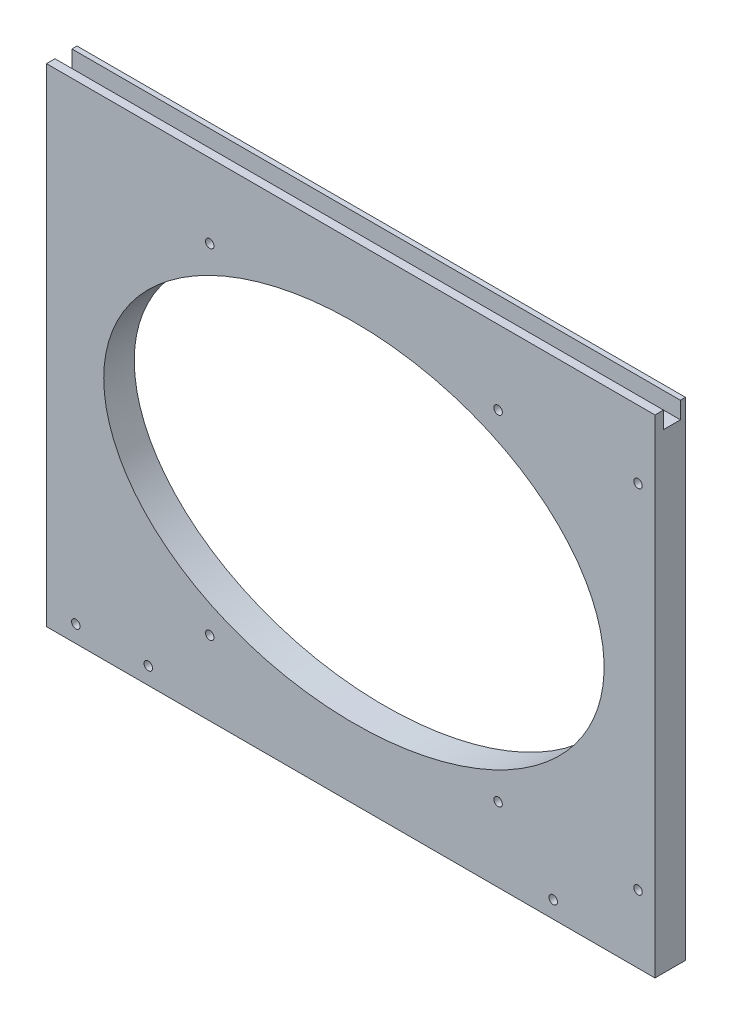
ISO-10303-21;
HEADER;
FILE_DESCRIPTION(('STEP AP214'),'2;1');
FILE_NAME('part.step','',(''),(''),'','','');
FILE_SCHEMA(('AUTOMOTIVE_DESIGN { 1 0 10303 214 1 1 1 1 }'));
ENDSEC;
DATA;
#1=APPLICATION_CONTEXT('core data for automotive mechanical design processes');
#2=APPLICATION_PROTOCOL_DEFINITION('international standard','automotive_design',2000,#1);
#3=PRODUCT_CONTEXT('',#1,'mechanical');
#4=PRODUCT('Part','Part','',(#3));
#5=PRODUCT_RELATED_PRODUCT_CATEGORY('part','',(#4));
#6=PRODUCT_DEFINITION_FORMATION('','',#4);
#7=PRODUCT_DEFINITION_CONTEXT('part definition',#1,'design');
#8=PRODUCT_DEFINITION('design','',#6,#7);
#9=PRODUCT_DEFINITION_SHAPE('','',#8);
#10=(LENGTH_UNIT() NAMED_UNIT(*) SI_UNIT(.MILLI.,.METRE.));
#11=(NAMED_UNIT(*) PLANE_ANGLE_UNIT() SI_UNIT($,.RADIAN.));
#12=(NAMED_UNIT(*) SI_UNIT($,.STERADIAN.) SOLID_ANGLE_UNIT());
#13=UNCERTAINTY_MEASURE_WITH_UNIT(LENGTH_MEASURE(1.E-05),#10,'distance_accuracy_value','');
#14=(GEOMETRIC_REPRESENTATION_CONTEXT(3) GLOBAL_UNCERTAINTY_ASSIGNED_CONTEXT((#13)) GLOBAL_UNIT_ASSIGNED_CONTEXT((#10,
#11,#12)) REPRESENTATION_CONTEXT('',''));
#15=CARTESIAN_POINT('',(0.,0.,0.));
#16=DIRECTION('',(0.,0.,1.));
#17=DIRECTION('',(1.,0.,0.));
#18=AXIS2_PLACEMENT_3D('',#15,#16,#17);
#19=CARTESIAN_POINT('',(-5512.59375,1181.1,-11.43));
#20=DIRECTION('',(0.,1.,0.));
#21=DIRECTION('',(0.,0.,1.));
#22=AXIS2_PLACEMENT_3D('',#19,#20,#21);
#23=PLANE('',#22);
#24=DIRECTION('',(1.,0.,0.));
#25=VECTOR('',#24,1.);
#26=CARTESIAN_POINT('',(-5749.38025612107,1181.1,-3.175));
#27=LINE('',#26,#25);
#28=CARTESIAN_POINT('',(-5740.4,1181.1,-3.175));
#29=VERTEX_POINT('',#28);
#30=CARTESIAN_POINT('',(-5512.59375,1181.1,-3.175));
#31=VERTEX_POINT('',#30);
#32=EDGE_CURVE('E109',#29,#31,#27,.T.);
#33=ORIENTED_EDGE('',*,*,#32,.F.);
#34=DIRECTION('',(0.,0.,1.));
#35=VECTOR('',#34,1.);
#36=CARTESIAN_POINT('',(-5740.4,1181.1,-11.43));
#37=LINE('',#36,#35);
#38=CARTESIAN_POINT('',(-5740.4,1181.1,0.));
#39=VERTEX_POINT('',#38);
#40=EDGE_CURVE('E118',#29,#39,#37,.T.);
#41=ORIENTED_EDGE('',*,*,#40,.T.);
#42=DIRECTION('',(-1.,0.,0.));
#43=VECTOR('',#42,1.);
#44=CARTESIAN_POINT('',(-5512.59375,1181.1,0.));
#45=LINE('',#44,#43);
#46=CARTESIAN_POINT('',(-5512.59375,1181.1,0.));
#47=VERTEX_POINT('',#46);
#48=EDGE_CURVE('E132',#47,#39,#45,.T.);
#49=ORIENTED_EDGE('',*,*,#48,.F.);
#50=DIRECTION('',(0.,0.,1.));
#51=VECTOR('',#50,1.);
#52=CARTESIAN_POINT('',(-5512.59375,1181.1,-11.43));
#53=LINE('',#52,#51);
#54=EDGE_CURVE('E120',#31,#47,#53,.T.);
#55=ORIENTED_EDGE('',*,*,#54,.F.);
#56=EDGE_LOOP('',(#33,#41,#49,#55));
#57=FACE_BOUND('',#56,.T.);
#58=ADVANCED_FACE('F31',(#57),#23,.T.);
#59=CARTESIAN_POINT('',(-5740.4,998.5375,-11.43));
#60=DIRECTION('',(0.,-1.,0.));
#61=DIRECTION('',(0.,0.,-1.));
#62=AXIS2_PLACEMENT_3D('',#59,#60,#61);
#63=PLANE('',#62);
#64=DIRECTION('',(1.,0.,0.));
#65=VECTOR('',#64,1.);
#66=CARTESIAN_POINT('',(-5740.4,998.5375,0.));
#67=LINE('',#66,#65);
#68=CARTESIAN_POINT('',(-5740.4,998.5375,0.));
#69=VERTEX_POINT('',#68);
#70=CARTESIAN_POINT('',(-5512.59375,998.5375,0.));
#71=VERTEX_POINT('',#70);
#72=EDGE_CURVE('E137',#69,#71,#67,.T.);
#73=ORIENTED_EDGE('',*,*,#72,.F.);
#74=DIRECTION('',(0.,0.,1.));
#75=VECTOR('',#74,1.);
#76=CARTESIAN_POINT('',(-5740.4,998.5375,-11.43));
#77=LINE('',#76,#75);
#78=CARTESIAN_POINT('',(-5740.4,998.5375,-11.43));
#79=VERTEX_POINT('',#78);
#80=EDGE_CURVE('E11',#79,#69,#77,.T.);
#81=ORIENTED_EDGE('',*,*,#80,.F.);
#82=DIRECTION('',(1.,0.,0.));
#83=VECTOR('',#82,1.);
#84=CARTESIAN_POINT('',(-5740.4,998.5375,-11.43));
#85=LINE('',#84,#83);
#86=CARTESIAN_POINT('',(-5512.59375,998.5375,-11.43));
#87=VERTEX_POINT('',#86);
#88=EDGE_CURVE('E131',#79,#87,#85,.T.);
#89=ORIENTED_EDGE('',*,*,#88,.T.);
#90=DIRECTION('',(0.,0.,1.));
#91=VECTOR('',#90,1.);
#92=CARTESIAN_POINT('',(-5512.59375,998.5375,-11.43));
#93=LINE('',#92,#91);
#94=EDGE_CURVE('E35',#87,#71,#93,.T.);
#95=ORIENTED_EDGE('',*,*,#94,.T.);
#96=EDGE_LOOP('',(#73,#81,#89,#95));
#97=FACE_BOUND('',#96,.T.);
#98=ADVANCED_FACE('F33',(#97),#63,.T.);
#99=CARTESIAN_POINT('',(-5740.4,1181.1,-11.43));
#100=DIRECTION('',(-1.,0.,0.));
#101=DIRECTION('',(0.,0.,1.));
#102=AXIS2_PLACEMENT_3D('',#99,#100,#101);
#103=PLANE('',#102);
#104=DIRECTION('',(0.,-1.,0.));
#105=VECTOR('',#104,1.);
#106=CARTESIAN_POINT('',(-5740.4,1181.1,-3.175));
#107=LINE('',#106,#105);
#108=CARTESIAN_POINT('',(-5740.4,1174.75,-3.175));
#109=VERTEX_POINT('',#108);
#110=EDGE_CURVE('E105',#29,#109,#107,.T.);
#111=ORIENTED_EDGE('',*,*,#110,.T.);
#112=DIRECTION('',(0.,0.,-1.));
#113=VECTOR('',#112,1.);
#114=CARTESIAN_POINT('',(-5740.4,1174.75,-3.175));
#115=LINE('',#114,#113);
#116=CARTESIAN_POINT('',(-5740.4,1174.75,-9.525));
#117=VERTEX_POINT('',#116);
#118=EDGE_CURVE('E203',#109,#117,#115,.T.);
#119=ORIENTED_EDGE('',*,*,#118,.T.);
#120=DIRECTION('',(0.,1.,0.));
#121=VECTOR('',#120,1.);
#122=CARTESIAN_POINT('',(-5740.4,1174.75,-9.525));
#123=LINE('',#122,#121);
#124=CARTESIAN_POINT('',(-5740.4,1181.1,-9.525));
#125=VERTEX_POINT('',#124);
#126=EDGE_CURVE('E198',#117,#125,#123,.T.);
#127=ORIENTED_EDGE('',*,*,#126,.T.);
#128=CARTESIAN_POINT('',(-5740.4,1181.1,-11.43));
#129=VERTEX_POINT('',#128);
#130=EDGE_CURVE('E40',#129,#125,#37,.T.);
#131=ORIENTED_EDGE('',*,*,#130,.F.);
#132=DIRECTION('',(0.,-1.,0.));
#133=VECTOR('',#132,1.);
#134=CARTESIAN_POINT('',(-5740.4,1181.1,-11.43));
#135=LINE('',#134,#133);
#136=EDGE_CURVE('E141',#129,#79,#135,.T.);
#137=ORIENTED_EDGE('',*,*,#136,.T.);
#138=ORIENTED_EDGE('',*,*,#80,.T.);
#139=DIRECTION('',(0.,-1.,0.));
#140=VECTOR('',#139,1.);
#141=CARTESIAN_POINT('',(-5740.4,1181.1,0.));
#142=LINE('',#141,#140);
#143=EDGE_CURVE('E124',#39,#69,#142,.T.);
#144=ORIENTED_EDGE('',*,*,#143,.F.);
#145=ORIENTED_EDGE('',*,*,#40,.F.);
#146=EDGE_LOOP('',(#111,#119,#127,#131,#137,#138,#144,#145));
#147=FACE_BOUND('',#146,.T.);
#148=ADVANCED_FACE('F122',(#147),#103,.T.);
#149=DIRECTION('',(1.,0.,0.));
#150=VECTOR('',#149,1.);
#151=CARTESIAN_POINT('',(-5749.38025612107,1181.1,-9.525));
#152=LINE('',#151,#150);
#153=CARTESIAN_POINT('',(-5512.59375,1181.1,-9.525));
#154=VERTEX_POINT('',#153);
#155=EDGE_CURVE('E201',#125,#154,#152,.T.);
#156=ORIENTED_EDGE('',*,*,#155,.T.);
#157=CARTESIAN_POINT('',(-5512.59375,1181.1,-11.43));
#158=VERTEX_POINT('',#157);
#159=EDGE_CURVE('E125',#158,#154,#53,.T.);
#160=ORIENTED_EDGE('',*,*,#159,.F.);
#161=DIRECTION('',(-1.,0.,0.));
#162=VECTOR('',#161,1.);
#163=CARTESIAN_POINT('',(-5512.59375,1181.1,-11.43));
#164=LINE('',#163,#162);
#165=EDGE_CURVE('E143',#158,#129,#164,.T.);
#166=ORIENTED_EDGE('',*,*,#165,.T.);
#167=ORIENTED_EDGE('',*,*,#130,.T.);
#168=EDGE_LOOP('',(#156,#160,#166,#167));
#169=FACE_BOUND('',#168,.T.);
#170=ADVANCED_FACE('F177',(#169),#23,.T.);
#171=CARTESIAN_POINT('',(-5512.59375,998.5375,-11.43));
#172=DIRECTION('',(1.,0.,0.));
#173=DIRECTION('',(0.,0.,-1.));
#174=AXIS2_PLACEMENT_3D('',#171,#172,#173);
#175=PLANE('',#174);
#176=DIRECTION('',(0.,-1.,0.));
#177=VECTOR('',#176,1.);
#178=CARTESIAN_POINT('',(-5512.59375,1181.1,-3.175));
#179=LINE('',#178,#177);
#180=CARTESIAN_POINT('',(-5512.59375,1174.75,-3.175));
#181=VERTEX_POINT('',#180);
#182=EDGE_CURVE('E190',#31,#181,#179,.T.);
#183=ORIENTED_EDGE('',*,*,#182,.F.);
#184=ORIENTED_EDGE('',*,*,#54,.T.);
#185=DIRECTION('',(0.,1.,0.));
#186=VECTOR('',#185,1.);
#187=CARTESIAN_POINT('',(-5512.59375,998.5375,0.));
#188=LINE('',#187,#186);
#189=EDGE_CURVE('E134',#71,#47,#188,.T.);
#190=ORIENTED_EDGE('',*,*,#189,.F.);
#191=ORIENTED_EDGE('',*,*,#94,.F.);
#192=DIRECTION('',(0.,1.,0.));
#193=VECTOR('',#192,1.);
#194=CARTESIAN_POINT('',(-5512.59375,998.5375,-11.43));
#195=LINE('',#194,#193);
#196=EDGE_CURVE('E146',#87,#158,#195,.T.);
#197=ORIENTED_EDGE('',*,*,#196,.T.);
#198=ORIENTED_EDGE('',*,*,#159,.T.);
#199=DIRECTION('',(0.,1.,0.));
#200=VECTOR('',#199,1.);
#201=CARTESIAN_POINT('',(-5512.59375,1174.75,-9.525));
#202=LINE('',#201,#200);
#203=CARTESIAN_POINT('',(-5512.59375,1174.75,-9.525));
#204=VERTEX_POINT('',#203);
#205=EDGE_CURVE('E192',#204,#154,#202,.T.);
#206=ORIENTED_EDGE('',*,*,#205,.F.);
#207=DIRECTION('',(0.,0.,-1.));
#208=VECTOR('',#207,1.);
#209=CARTESIAN_POINT('',(-5512.59375,1174.75,-3.175));
#210=LINE('',#209,#208);
#211=EDGE_CURVE('E48',#181,#204,#210,.T.);
#212=ORIENTED_EDGE('',*,*,#211,.F.);
#213=EDGE_LOOP('',(#183,#184,#190,#191,#197,#198,#206,#212));
#214=FACE_BOUND('',#213,.T.);
#215=ADVANCED_FACE('F170',(#214),#175,.T.);
#216=CARTESIAN_POINT('',(-5512.59375,998.5375,-11.43));
#217=DIRECTION('',(0.,0.,1.));
#218=DIRECTION('',(1.,0.,0.));
#219=AXIS2_PLACEMENT_3D('',#216,#217,#218);
#220=PLANE('',#219);
#221=CARTESIAN_POINT('',(-5729.43355,1004.8875,-11.43));
#222=DIRECTION('',(0.,0.,-1.));
#223=DIRECTION('',(-1.,0.,0.));
#224=AXIS2_PLACEMENT_3D('',#221,#222,#223);
#225=CIRCLE('',#224,1.5874999999996);
#226=CARTESIAN_POINT('',(-5731.02105,1004.8875,-11.43));
#227=VERTEX_POINT('',#226);
#228=EDGE_CURVE('E430',#227,#227,#225,.T.);
#229=ORIENTED_EDGE('',*,*,#228,.F.);
#230=EDGE_LOOP('',(#229));
#231=FACE_BOUND('',#230,.T.);
#232=CARTESIAN_POINT('',(-5679.28125,1153.31875,-11.43));
#233=DIRECTION('',(0.,0.,1.));
#234=DIRECTION('',(1.,0.,0.));
#235=AXIS2_PLACEMENT_3D('',#232,#233,#234);
#236=CIRCLE('',#235,1.58750000000051);
#237=CARTESIAN_POINT('',(-5677.69375,1153.31875,-11.43));
#238=VERTEX_POINT('',#237);
#239=EDGE_CURVE('E212',#238,#238,#236,.F.);
#240=ORIENTED_EDGE('',*,*,#239,.F.);
#241=EDGE_LOOP('',(#240));
#242=FACE_BOUND('',#241,.T.);
#243=CARTESIAN_POINT('',(-5702.3,1004.8875,-11.43));
#244=DIRECTION('',(0.,0.,1.));
#245=DIRECTION('',(1.,0.,0.));
#246=AXIS2_PLACEMENT_3D('',#243,#244,#245);
#247=CIRCLE('',#246,1.58750000000051);
#248=CARTESIAN_POINT('',(-5700.7125,1004.8875,-11.43));
#249=VERTEX_POINT('',#248);
#250=EDGE_CURVE('E218',#249,#249,#247,.F.);
#251=ORIENTED_EDGE('',*,*,#250,.F.);
#252=EDGE_LOOP('',(#251));
#253=FACE_BOUND('',#252,.T.);
#254=CARTESIAN_POINT('',(-5679.28125,1026.31875,-11.43));
#255=DIRECTION('',(0.,0.,1.));
#256=DIRECTION('',(1.,0.,0.));
#257=AXIS2_PLACEMENT_3D('',#254,#255,#256);
#258=CIRCLE('',#257,1.58750000000045);
#259=CARTESIAN_POINT('',(-5677.69375,1026.31875,-11.43));
#260=VERTEX_POINT('',#259);
#261=EDGE_CURVE('E224',#260,#260,#258,.F.);
#262=ORIENTED_EDGE('',*,*,#261,.F.);
#263=EDGE_LOOP('',(#262));
#264=FACE_BOUND('',#263,.T.);
#265=CARTESIAN_POINT('',(-5571.33125,1026.31875,-11.43));
#266=DIRECTION('',(0.,0.,1.));
#267=DIRECTION('',(1.,0.,0.));
#268=AXIS2_PLACEMENT_3D('',#265,#266,#267);
#269=CIRCLE('',#268,1.58750000000045);
#270=CARTESIAN_POINT('',(-5569.74375,1026.31875,-11.43));
#271=VERTEX_POINT('',#270);
#272=EDGE_CURVE('E230',#271,#271,#269,.F.);
#273=ORIENTED_EDGE('',*,*,#272,.F.);
#274=EDGE_LOOP('',(#273));
#275=FACE_BOUND('',#274,.T.);
#276=CARTESIAN_POINT('',(-5550.69375,1004.8875,-11.43));
#277=DIRECTION('',(0.,0.,1.));
#278=DIRECTION('',(1.,0.,0.));
#279=AXIS2_PLACEMENT_3D('',#276,#277,#278);
#280=CIRCLE('',#279,1.58750000000051);
#281=CARTESIAN_POINT('',(-5549.10625,1004.8875,-11.43));
#282=VERTEX_POINT('',#281);
#283=EDGE_CURVE('E236',#282,#282,#280,.F.);
#284=ORIENTED_EDGE('',*,*,#283,.F.);
#285=EDGE_LOOP('',(#284));
#286=FACE_BOUND('',#285,.T.);
#287=CARTESIAN_POINT('',(-5518.94375,1023.9375,-11.43));
#288=DIRECTION('',(0.,0.,1.));
#289=DIRECTION('',(1.,0.,0.));
#290=AXIS2_PLACEMENT_3D('',#287,#288,#289);
#291=CIRCLE('',#290,1.58750000000051);
#292=CARTESIAN_POINT('',(-5517.35625,1023.9375,-11.43));
#293=VERTEX_POINT('',#292);
#294=EDGE_CURVE('E242',#293,#293,#291,.F.);
#295=ORIENTED_EDGE('',*,*,#294,.F.);
#296=EDGE_LOOP('',(#295));
#297=FACE_BOUND('',#296,.T.);
#298=CARTESIAN_POINT('',(-5518.94375,1155.7,-11.43));
#299=DIRECTION('',(0.,0.,1.));
#300=DIRECTION('',(1.,0.,0.));
#301=AXIS2_PLACEMENT_3D('',#298,#299,#300);
#302=CIRCLE('',#301,1.58750000000051);
#303=CARTESIAN_POINT('',(-5517.35625,1155.7,-11.43));
#304=VERTEX_POINT('',#303);
#305=EDGE_CURVE('E248',#304,#304,#302,.F.);
#306=ORIENTED_EDGE('',*,*,#305,.F.);
#307=EDGE_LOOP('',(#306));
#308=FACE_BOUND('',#307,.T.);
#309=CARTESIAN_POINT('',(-5571.33125,1153.31875,-11.43));
#310=DIRECTION('',(0.,0.,1.));
#311=DIRECTION('',(1.,0.,0.));
#312=AXIS2_PLACEMENT_3D('',#309,#310,#311);
#313=CIRCLE('',#312,1.58750000000045);
#314=CARTESIAN_POINT('',(-5569.74375,1153.31875,-11.43));
#315=VERTEX_POINT('',#314);
#316=EDGE_CURVE('E154',#315,#315,#313,.F.);
#317=ORIENTED_EDGE('',*,*,#316,.F.);
#318=EDGE_LOOP('',(#317));
#319=FACE_BOUND('',#318,.T.);
#320=CARTESIAN_POINT('',(-5625.30625,1089.81875,-11.43));
#321=DIRECTION('',(0.,0.,1.));
#322=DIRECTION('',(-1.,0.,0.));
#323=AXIS2_PLACEMENT_3D('',#320,#321,#322);
#324=ELLIPSE('',#323,93.6624999999998,65.0874999965074);
#325=CARTESIAN_POINT('',(-5718.96875,1089.81875,-11.43));
#326=VERTEX_POINT('',#325);
#327=EDGE_CURVE('E140',#326,#326,#324,.F.);
#328=ORIENTED_EDGE('',*,*,#327,.F.);
#329=EDGE_LOOP('',(#328));
#330=FACE_BOUND('',#329,.T.);
#331=ORIENTED_EDGE('',*,*,#88,.F.);
#332=ORIENTED_EDGE('',*,*,#136,.F.);
#333=ORIENTED_EDGE('',*,*,#165,.F.);
#334=ORIENTED_EDGE('',*,*,#196,.F.);
#335=EDGE_LOOP('',(#331,#332,#333,#334));
#336=FACE_BOUND('',#335,.T.);
#337=ADVANCED_FACE('F167',(#231,#242,#253,#264,#275,#286,#297,#308,#319,#330,#336),#220,.F.);
#338=CARTESIAN_POINT('',(-5512.59375,998.5375,0.));
#339=DIRECTION('',(0.,0.,1.));
#340=DIRECTION('',(1.,0.,0.));
#341=AXIS2_PLACEMENT_3D('',#338,#339,#340);
#342=PLANE('',#341);
#343=CARTESIAN_POINT('',(-5729.43355,1004.8875,0.));
#344=DIRECTION('',(0.,0.,1.));
#345=DIRECTION('',(1.,0.,0.));
#346=AXIS2_PLACEMENT_3D('',#343,#344,#345);
#347=CIRCLE('',#346,1.5874999999996);
#348=CARTESIAN_POINT('',(-5727.84605,1004.8875,0.));
#349=VERTEX_POINT('',#348);
#350=EDGE_CURVE('E195',#349,#349,#347,.F.);
#351=ORIENTED_EDGE('',*,*,#350,.T.);
#352=EDGE_LOOP('',(#351));
#353=FACE_BOUND('',#352,.T.);
#354=CARTESIAN_POINT('',(-5679.28125,1153.31875,0.));
#355=DIRECTION('',(0.,0.,1.));
#356=DIRECTION('',(1.,0.,0.));
#357=AXIS2_PLACEMENT_3D('',#354,#355,#356);
#358=CIRCLE('',#357,1.58750000000051);
#359=CARTESIAN_POINT('',(-5677.69375,1153.31875,0.));
#360=VERTEX_POINT('',#359);
#361=EDGE_CURVE('E207',#360,#360,#358,.T.);
#362=ORIENTED_EDGE('',*,*,#361,.F.);
#363=EDGE_LOOP('',(#362));
#364=FACE_BOUND('',#363,.T.);
#365=CARTESIAN_POINT('',(-5702.3,1004.8875,0.));
#366=DIRECTION('',(0.,0.,1.));
#367=DIRECTION('',(1.,0.,0.));
#368=AXIS2_PLACEMENT_3D('',#365,#366,#367);
#369=CIRCLE('',#368,1.58750000000051);
#370=CARTESIAN_POINT('',(-5700.7125,1004.8875,0.));
#371=VERTEX_POINT('',#370);
#372=EDGE_CURVE('E215',#371,#371,#369,.T.);
#373=ORIENTED_EDGE('',*,*,#372,.F.);
#374=EDGE_LOOP('',(#373));
#375=FACE_BOUND('',#374,.T.);
#376=CARTESIAN_POINT('',(-5679.28125,1026.31875,0.));
#377=DIRECTION('',(0.,0.,1.));
#378=DIRECTION('',(1.,0.,0.));
#379=AXIS2_PLACEMENT_3D('',#376,#377,#378);
#380=CIRCLE('',#379,1.58750000000045);
#381=CARTESIAN_POINT('',(-5677.69375,1026.31875,0.));
#382=VERTEX_POINT('',#381);
#383=EDGE_CURVE('E221',#382,#382,#380,.T.);
#384=ORIENTED_EDGE('',*,*,#383,.F.);
#385=EDGE_LOOP('',(#384));
#386=FACE_BOUND('',#385,.T.);
#387=CARTESIAN_POINT('',(-5571.33125,1026.31875,0.));
#388=DIRECTION('',(0.,0.,1.));
#389=DIRECTION('',(1.,0.,0.));
#390=AXIS2_PLACEMENT_3D('',#387,#388,#389);
#391=CIRCLE('',#390,1.58750000000045);
#392=CARTESIAN_POINT('',(-5569.74375,1026.31875,0.));
#393=VERTEX_POINT('',#392);
#394=EDGE_CURVE('E227',#393,#393,#391,.T.);
#395=ORIENTED_EDGE('',*,*,#394,.F.);
#396=EDGE_LOOP('',(#395));
#397=FACE_BOUND('',#396,.T.);
#398=CARTESIAN_POINT('',(-5550.69375,1004.8875,0.));
#399=DIRECTION('',(0.,0.,1.));
#400=DIRECTION('',(1.,0.,0.));
#401=AXIS2_PLACEMENT_3D('',#398,#399,#400);
#402=CIRCLE('',#401,1.58750000000051);
#403=CARTESIAN_POINT('',(-5549.10625,1004.8875,0.));
#404=VERTEX_POINT('',#403);
#405=EDGE_CURVE('E233',#404,#404,#402,.T.);
#406=ORIENTED_EDGE('',*,*,#405,.F.);
#407=EDGE_LOOP('',(#406));
#408=FACE_BOUND('',#407,.T.);
#409=CARTESIAN_POINT('',(-5518.94375,1023.9375,0.));
#410=DIRECTION('',(0.,0.,1.));
#411=DIRECTION('',(1.,0.,0.));
#412=AXIS2_PLACEMENT_3D('',#409,#410,#411);
#413=CIRCLE('',#412,1.58750000000051);
#414=CARTESIAN_POINT('',(-5517.35625,1023.9375,0.));
#415=VERTEX_POINT('',#414);
#416=EDGE_CURVE('E239',#415,#415,#413,.T.);
#417=ORIENTED_EDGE('',*,*,#416,.F.);
#418=EDGE_LOOP('',(#417));
#419=FACE_BOUND('',#418,.T.);
#420=CARTESIAN_POINT('',(-5518.94375,1155.7,0.));
#421=DIRECTION('',(0.,0.,1.));
#422=DIRECTION('',(1.,0.,0.));
#423=AXIS2_PLACEMENT_3D('',#420,#421,#422);
#424=CIRCLE('',#423,1.58750000000051);
#425=CARTESIAN_POINT('',(-5517.35625,1155.7,0.));
#426=VERTEX_POINT('',#425);
#427=EDGE_CURVE('E245',#426,#426,#424,.T.);
#428=ORIENTED_EDGE('',*,*,#427,.F.);
#429=EDGE_LOOP('',(#428));
#430=FACE_BOUND('',#429,.T.);
#431=CARTESIAN_POINT('',(-5571.33125,1153.31875,0.));
#432=DIRECTION('',(0.,0.,1.));
#433=DIRECTION('',(1.,0.,0.));
#434=AXIS2_PLACEMENT_3D('',#431,#432,#433);
#435=CIRCLE('',#434,1.58750000000045);
#436=CARTESIAN_POINT('',(-5569.74375,1153.31875,0.));
#437=VERTEX_POINT('',#436);
#438=EDGE_CURVE('E250',#437,#437,#435,.T.);
#439=ORIENTED_EDGE('',*,*,#438,.F.);
#440=EDGE_LOOP('',(#439));
#441=FACE_BOUND('',#440,.T.);
#442=CARTESIAN_POINT('',(-5625.30625,1089.81875,0.));
#443=DIRECTION('',(0.,0.,1.));
#444=DIRECTION('',(-1.,0.,0.));
#445=AXIS2_PLACEMENT_3D('',#442,#443,#444);
#446=ELLIPSE('',#445,93.6624999999998,65.0874999965074);
#447=CARTESIAN_POINT('',(-5718.96875,1089.81875,0.));
#448=VERTEX_POINT('',#447);
#449=EDGE_CURVE('E151',#448,#448,#446,.T.);
#450=ORIENTED_EDGE('',*,*,#449,.F.);
#451=EDGE_LOOP('',(#450));
#452=FACE_BOUND('',#451,.T.);
#453=ORIENTED_EDGE('',*,*,#72,.T.);
#454=ORIENTED_EDGE('',*,*,#189,.T.);
#455=ORIENTED_EDGE('',*,*,#48,.T.);
#456=ORIENTED_EDGE('',*,*,#143,.T.);
#457=EDGE_LOOP('',(#453,#454,#455,#456));
#458=FACE_BOUND('',#457,.T.);
#459=ADVANCED_FACE('F164',(#353,#364,#375,#386,#397,#408,#419,#430,#441,#452,#458),#342,.T.);
#460=CARTESIAN_POINT('',(-5625.30625,1089.81875,-239.544414818926));
#461=DIRECTION('',(0.,0.,1.));
#462=DIRECTION('',(-1.,0.,0.));
#463=AXIS2_PLACEMENT_3D('',#460,#461,#462);
#464=ELLIPSE('',#463,93.6624999999998,65.0874999965074);
#465=DIRECTION('',(0.,0.,1.));
#466=VECTOR('',#465,1.);
#467=SURFACE_OF_LINEAR_EXTRUSION('',#464,#466);
#468=ORIENTED_EDGE('',*,*,#327,.T.);
#469=EDGE_LOOP('',(#468));
#470=FACE_BOUND('',#469,.T.);
#471=ORIENTED_EDGE('',*,*,#449,.T.);
#472=EDGE_LOOP('',(#471));
#473=FACE_BOUND('',#472,.T.);
#474=ADVANCED_FACE('F159',(#470,#473),#467,.F.);
#475=CARTESIAN_POINT('',(-5571.33125,1153.31875,-239.544414818926));
#476=DIRECTION('',(0.,0.,1.));
#477=DIRECTION('',(1.,0.,0.));
#478=AXIS2_PLACEMENT_3D('',#475,#476,#477);
#479=CYLINDRICAL_SURFACE('',#478,1.58750000000045);
#480=ORIENTED_EDGE('',*,*,#316,.T.);
#481=EDGE_LOOP('',(#480));
#482=FACE_BOUND('',#481,.T.);
#483=ORIENTED_EDGE('',*,*,#438,.T.);
#484=EDGE_LOOP('',(#483));
#485=FACE_BOUND('',#484,.T.);
#486=ADVANCED_FACE('F163',(#482,#485),#479,.F.);
#487=CARTESIAN_POINT('',(-5518.94375,1155.7,-239.544414818926));
#488=DIRECTION('',(0.,0.,1.));
#489=DIRECTION('',(1.,0.,0.));
#490=AXIS2_PLACEMENT_3D('',#487,#488,#489);
#491=CYLINDRICAL_SURFACE('',#490,1.58750000000051);
#492=ORIENTED_EDGE('',*,*,#305,.T.);
#493=EDGE_LOOP('',(#492));
#494=FACE_BOUND('',#493,.T.);
#495=ORIENTED_EDGE('',*,*,#427,.T.);
#496=EDGE_LOOP('',(#495));
#497=FACE_BOUND('',#496,.T.);
#498=ADVANCED_FACE('F299',(#494,#497),#491,.F.);
#499=CARTESIAN_POINT('',(-5518.94375,1023.9375,-239.544414818926));
#500=DIRECTION('',(0.,0.,1.));
#501=DIRECTION('',(1.,0.,0.));
#502=AXIS2_PLACEMENT_3D('',#499,#500,#501);
#503=CYLINDRICAL_SURFACE('',#502,1.58750000000051);
#504=ORIENTED_EDGE('',*,*,#294,.T.);
#505=EDGE_LOOP('',(#504));
#506=FACE_BOUND('',#505,.T.);
#507=ORIENTED_EDGE('',*,*,#416,.T.);
#508=EDGE_LOOP('',(#507));
#509=FACE_BOUND('',#508,.T.);
#510=ADVANCED_FACE('F296',(#506,#509),#503,.F.);
#511=CARTESIAN_POINT('',(-5550.69375,1004.8875,-239.544414818926));
#512=DIRECTION('',(0.,0.,1.));
#513=DIRECTION('',(1.,0.,0.));
#514=AXIS2_PLACEMENT_3D('',#511,#512,#513);
#515=CYLINDRICAL_SURFACE('',#514,1.58750000000051);
#516=ORIENTED_EDGE('',*,*,#283,.T.);
#517=EDGE_LOOP('',(#516));
#518=FACE_BOUND('',#517,.T.);
#519=ORIENTED_EDGE('',*,*,#405,.T.);
#520=EDGE_LOOP('',(#519));
#521=FACE_BOUND('',#520,.T.);
#522=ADVANCED_FACE('F292',(#518,#521),#515,.F.);
#523=CARTESIAN_POINT('',(-5571.33125,1026.31875,-239.544414818926));
#524=DIRECTION('',(0.,0.,1.));
#525=DIRECTION('',(1.,0.,0.));
#526=AXIS2_PLACEMENT_3D('',#523,#524,#525);
#527=CYLINDRICAL_SURFACE('',#526,1.58750000000045);
#528=ORIENTED_EDGE('',*,*,#272,.T.);
#529=EDGE_LOOP('',(#528));
#530=FACE_BOUND('',#529,.T.);
#531=ORIENTED_EDGE('',*,*,#394,.T.);
#532=EDGE_LOOP('',(#531));
#533=FACE_BOUND('',#532,.T.);
#534=ADVANCED_FACE('F288',(#530,#533),#527,.F.);
#535=CARTESIAN_POINT('',(-5679.28125,1026.31875,-239.544414818926));
#536=DIRECTION('',(0.,0.,1.));
#537=DIRECTION('',(1.,0.,0.));
#538=AXIS2_PLACEMENT_3D('',#535,#536,#537);
#539=CYLINDRICAL_SURFACE('',#538,1.58750000000045);
#540=ORIENTED_EDGE('',*,*,#261,.T.);
#541=EDGE_LOOP('',(#540));
#542=FACE_BOUND('',#541,.T.);
#543=ORIENTED_EDGE('',*,*,#383,.T.);
#544=EDGE_LOOP('',(#543));
#545=FACE_BOUND('',#544,.T.);
#546=ADVANCED_FACE('F284',(#542,#545),#539,.F.);
#547=CARTESIAN_POINT('',(-5702.3,1004.8875,-239.544414818926));
#548=DIRECTION('',(0.,0.,1.));
#549=DIRECTION('',(1.,0.,0.));
#550=AXIS2_PLACEMENT_3D('',#547,#548,#549);
#551=CYLINDRICAL_SURFACE('',#550,1.58750000000051);
#552=ORIENTED_EDGE('',*,*,#250,.T.);
#553=EDGE_LOOP('',(#552));
#554=FACE_BOUND('',#553,.T.);
#555=ORIENTED_EDGE('',*,*,#372,.T.);
#556=EDGE_LOOP('',(#555));
#557=FACE_BOUND('',#556,.T.);
#558=ADVANCED_FACE('F280',(#554,#557),#551,.F.);
#559=CARTESIAN_POINT('',(-5679.28125,1153.31875,-239.544414818926));
#560=DIRECTION('',(0.,0.,1.));
#561=DIRECTION('',(1.,0.,0.));
#562=AXIS2_PLACEMENT_3D('',#559,#560,#561);
#563=CYLINDRICAL_SURFACE('',#562,1.58750000000051);
#564=ORIENTED_EDGE('',*,*,#239,.T.);
#565=EDGE_LOOP('',(#564));
#566=FACE_BOUND('',#565,.T.);
#567=ORIENTED_EDGE('',*,*,#361,.T.);
#568=EDGE_LOOP('',(#567));
#569=FACE_BOUND('',#568,.T.);
#570=ADVANCED_FACE('F274',(#566,#569),#563,.F.);
#571=CARTESIAN_POINT('',(-5749.38025612107,1181.1,-3.175));
#572=DIRECTION('',(0.,0.,1.));
#573=DIRECTION('',(0.,-1.,0.));
#574=AXIS2_PLACEMENT_3D('',#571,#572,#573);
#575=PLANE('',#574);
#576=ORIENTED_EDGE('',*,*,#32,.T.);
#577=ORIENTED_EDGE('',*,*,#182,.T.);
#578=DIRECTION('',(1.,0.,0.));
#579=VECTOR('',#578,1.);
#580=CARTESIAN_POINT('',(-5749.38025612107,1174.75,-3.175));
#581=LINE('',#580,#579);
#582=EDGE_CURVE('E111',#109,#181,#581,.T.);
#583=ORIENTED_EDGE('',*,*,#582,.F.);
#584=ORIENTED_EDGE('',*,*,#110,.F.);
#585=EDGE_LOOP('',(#576,#577,#583,#584));
#586=FACE_BOUND('',#585,.T.);
#587=ADVANCED_FACE('F107',(#586),#575,.F.);
#588=CARTESIAN_POINT('',(-5749.38025612107,1174.75,-3.175));
#589=DIRECTION('',(0.,-1.,0.));
#590=DIRECTION('',(0.,0.,-1.));
#591=AXIS2_PLACEMENT_3D('',#588,#589,#590);
#592=PLANE('',#591);
#593=ORIENTED_EDGE('',*,*,#582,.T.);
#594=ORIENTED_EDGE('',*,*,#211,.T.);
#595=DIRECTION('',(1.,0.,0.));
#596=VECTOR('',#595,1.);
#597=CARTESIAN_POINT('',(-5749.38025612107,1174.75,-9.525));
#598=LINE('',#597,#596);
#599=EDGE_CURVE('E202',#117,#204,#598,.T.);
#600=ORIENTED_EDGE('',*,*,#599,.F.);
#601=ORIENTED_EDGE('',*,*,#118,.F.);
#602=EDGE_LOOP('',(#593,#594,#600,#601));
#603=FACE_BOUND('',#602,.T.);
#604=ADVANCED_FACE('F265',(#603),#592,.F.);
#605=CARTESIAN_POINT('',(-5749.38025612107,1174.75,-9.525));
#606=DIRECTION('',(0.,0.,-1.));
#607=DIRECTION('',(-1.,0.,0.));
#608=AXIS2_PLACEMENT_3D('',#605,#606,#607);
#609=PLANE('',#608);
#610=ORIENTED_EDGE('',*,*,#599,.T.);
#611=ORIENTED_EDGE('',*,*,#205,.T.);
#612=ORIENTED_EDGE('',*,*,#155,.F.);
#613=ORIENTED_EDGE('',*,*,#126,.F.);
#614=EDGE_LOOP('',(#610,#611,#612,#613));
#615=FACE_BOUND('',#614,.T.);
#616=ADVANCED_FACE('F264',(#615),#609,.F.);
#617=CARTESIAN_POINT('',(-5729.43355,1004.8875,4.49012806053322));
#618=DIRECTION('',(0.,0.,-1.));
#619=DIRECTION('',(-1.,0.,0.));
#620=AXIS2_PLACEMENT_3D('',#617,#618,#619);
#621=CYLINDRICAL_SURFACE('',#620,1.5874999999996);
#622=ORIENTED_EDGE('',*,*,#228,.T.);
#623=EDGE_LOOP('',(#622));
#624=FACE_BOUND('',#623,.T.);
#625=ORIENTED_EDGE('',*,*,#350,.F.);
#626=EDGE_LOOP('',(#625));
#627=FACE_BOUND('',#626,.T.);
#628=ADVANCED_FACE('F272',(#624,#627),#621,.F.);
#629=CLOSED_SHELL('',(#58,#98,#148,#170,#215,#337,#459,#474,#486,#498,#510,#522,#534,#546,#558,
#570,#587,#604,#616,#628));
#630=MANIFOLD_SOLID_BREP('B2',#629);
#631=ADVANCED_BREP_SHAPE_REPRESENTATION('',(#18,#630),#14);
#632=SHAPE_DEFINITION_REPRESENTATION(#9,#631);
ENDSEC;
END-ISO-10303-21;
